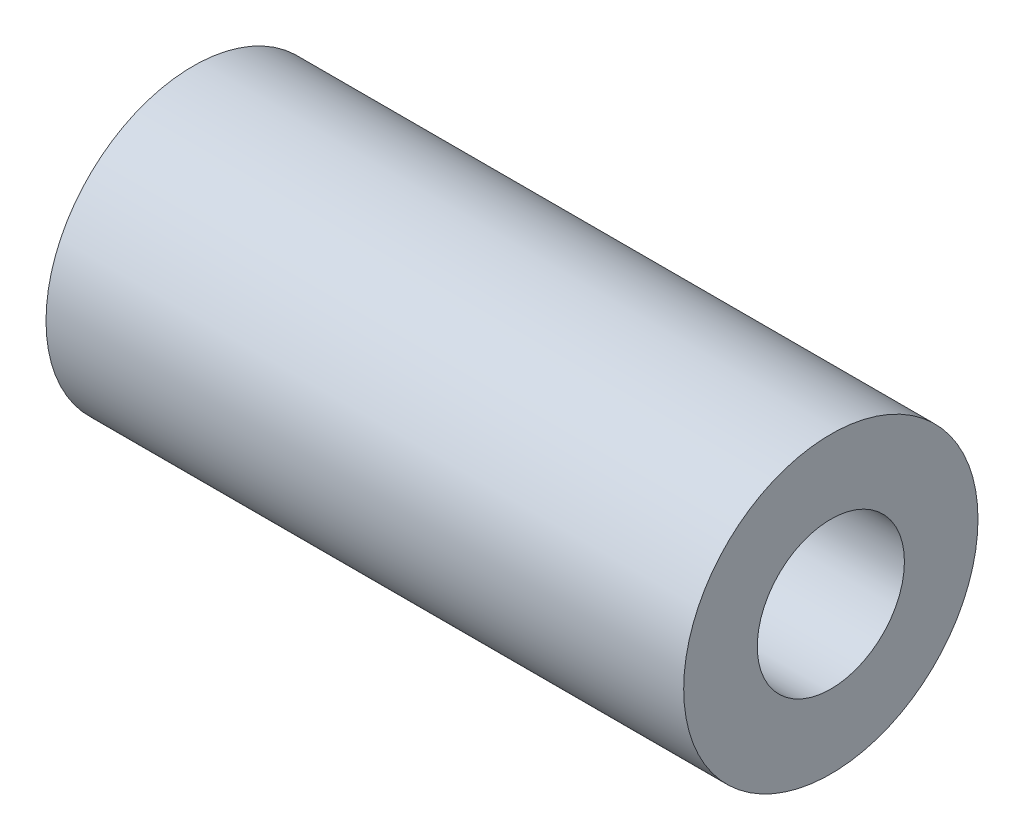
ISO-10303-21;
HEADER;
FILE_DESCRIPTION(('STEP AP214'),'2;1');
FILE_NAME('part.step','',(''),(''),'','','');
FILE_SCHEMA(('AUTOMOTIVE_DESIGN { 1 0 10303 214 1 1 1 1 }'));
ENDSEC;
DATA;
#1=APPLICATION_CONTEXT('core data for automotive mechanical design processes');
#2=APPLICATION_PROTOCOL_DEFINITION('international standard','automotive_design',2000,#1);
#3=PRODUCT_CONTEXT('',#1,'mechanical');
#4=PRODUCT('Part','Part','',(#3));
#5=PRODUCT_RELATED_PRODUCT_CATEGORY('part','',(#4));
#6=PRODUCT_DEFINITION_FORMATION('','',#4);
#7=PRODUCT_DEFINITION_CONTEXT('part definition',#1,'design');
#8=PRODUCT_DEFINITION('design','',#6,#7);
#9=PRODUCT_DEFINITION_SHAPE('','',#8);
#10=(LENGTH_UNIT() NAMED_UNIT(*) SI_UNIT(.MILLI.,.METRE.));
#11=(NAMED_UNIT(*) PLANE_ANGLE_UNIT() SI_UNIT($,.RADIAN.));
#12=(NAMED_UNIT(*) SI_UNIT($,.STERADIAN.) SOLID_ANGLE_UNIT());
#13=UNCERTAINTY_MEASURE_WITH_UNIT(LENGTH_MEASURE(1.E-05),#10,'distance_accuracy_value','');
#14=(GEOMETRIC_REPRESENTATION_CONTEXT(3) GLOBAL_UNCERTAINTY_ASSIGNED_CONTEXT((#13)) GLOBAL_UNIT_ASSIGNED_CONTEXT((#10,
#11,#12)) REPRESENTATION_CONTEXT('',''));
#15=CARTESIAN_POINT('',(0.,0.,0.));
#16=DIRECTION('',(0.,0.,1.));
#17=DIRECTION('',(1.,0.,0.));
#18=AXIS2_PLACEMENT_3D('',#15,#16,#17);
#19=CARTESIAN_POINT('',(13.,0.,0.));
#20=DIRECTION('',(1.,0.,0.));
#21=DIRECTION('',(0.,0.,-1.));
#22=AXIS2_PLACEMENT_3D('',#19,#20,#21);
#23=PLANE('',#22);
#24=CARTESIAN_POINT('',(13.,0.,0.));
#25=DIRECTION('',(1.,0.,0.));
#26=DIRECTION('',(0.,0.,-1.));
#27=AXIS2_PLACEMENT_3D('',#24,#25,#26);
#28=CIRCLE('',#27,3.);
#29=CARTESIAN_POINT('',(13.,0.,-3.));
#30=VERTEX_POINT('',#29);
#31=EDGE_CURVE('E10',#30,#30,#28,.T.);
#32=ORIENTED_EDGE('',*,*,#31,.T.);
#33=EDGE_LOOP('',(#32));
#34=FACE_BOUND('',#33,.T.);
#35=CARTESIAN_POINT('',(13.,0.,0.));
#36=DIRECTION('',(1.,0.,0.));
#37=DIRECTION('',(0.,0.,-1.));
#38=AXIS2_PLACEMENT_3D('',#35,#36,#37);
#39=CIRCLE('',#38,1.5);
#40=CARTESIAN_POINT('',(13.,0.,-1.5));
#41=VERTEX_POINT('',#40);
#42=EDGE_CURVE('E44',#41,#41,#39,.T.);
#43=ORIENTED_EDGE('',*,*,#42,.F.);
#44=EDGE_LOOP('',(#43));
#45=FACE_BOUND('',#44,.T.);
#46=ADVANCED_FACE('F33',(#34,#45),#23,.T.);
#47=CARTESIAN_POINT('',(0.,0.,0.));
#48=DIRECTION('',(1.,0.,0.));
#49=DIRECTION('',(0.,0.,-1.));
#50=AXIS2_PLACEMENT_3D('',#47,#48,#49);
#51=PLANE('',#50);
#52=CARTESIAN_POINT('',(0.,0.,0.));
#53=DIRECTION('',(1.,0.,0.));
#54=DIRECTION('',(0.,0.,-1.));
#55=AXIS2_PLACEMENT_3D('',#52,#53,#54);
#56=CIRCLE('',#55,3.);
#57=CARTESIAN_POINT('',(0.,0.,-3.));
#58=VERTEX_POINT('',#57);
#59=EDGE_CURVE('E37',#58,#58,#56,.T.);
#60=ORIENTED_EDGE('',*,*,#59,.F.);
#61=EDGE_LOOP('',(#60));
#62=FACE_BOUND('',#61,.T.);
#63=CARTESIAN_POINT('',(0.,0.,0.));
#64=DIRECTION('',(1.,0.,0.));
#65=DIRECTION('',(0.,0.,-1.));
#66=AXIS2_PLACEMENT_3D('',#63,#64,#65);
#67=CIRCLE('',#66,1.5);
#68=CARTESIAN_POINT('',(0.,0.,-1.5));
#69=VERTEX_POINT('',#68);
#70=EDGE_CURVE('E46',#69,#69,#67,.T.);
#71=ORIENTED_EDGE('',*,*,#70,.T.);
#72=EDGE_LOOP('',(#71));
#73=FACE_BOUND('',#72,.T.);
#74=ADVANCED_FACE('F56',(#62,#73),#51,.F.);
#75=CARTESIAN_POINT('',(13.,0.,0.));
#76=DIRECTION('',(-1.,0.,0.));
#77=DIRECTION('',(0.,0.,1.));
#78=AXIS2_PLACEMENT_3D('',#75,#76,#77);
#79=CYLINDRICAL_SURFACE('',#78,3.);
#80=ORIENTED_EDGE('',*,*,#31,.F.);
#81=EDGE_LOOP('',(#80));
#82=FACE_BOUND('',#81,.T.);
#83=ORIENTED_EDGE('',*,*,#59,.T.);
#84=EDGE_LOOP('',(#83));
#85=FACE_BOUND('',#84,.T.);
#86=ADVANCED_FACE('F35',(#82,#85),#79,.T.);
#87=CARTESIAN_POINT('',(13.,0.,0.));
#88=DIRECTION('',(-1.,0.,0.));
#89=DIRECTION('',(0.,0.,1.));
#90=AXIS2_PLACEMENT_3D('',#87,#88,#89);
#91=CYLINDRICAL_SURFACE('',#90,1.5);
#92=ORIENTED_EDGE('',*,*,#42,.T.);
#93=EDGE_LOOP('',(#92));
#94=FACE_BOUND('',#93,.T.);
#95=ORIENTED_EDGE('',*,*,#70,.F.);
#96=EDGE_LOOP('',(#95));
#97=FACE_BOUND('',#96,.T.);
#98=ADVANCED_FACE('F52',(#94,#97),#91,.F.);
#99=CLOSED_SHELL('',(#46,#74,#86,#98));
#100=MANIFOLD_SOLID_BREP('B2',#99);
#101=ADVANCED_BREP_SHAPE_REPRESENTATION('',(#18,#100),#14);
#102=SHAPE_DEFINITION_REPRESENTATION(#9,#101);
ENDSEC;
END-ISO-10303-21;
